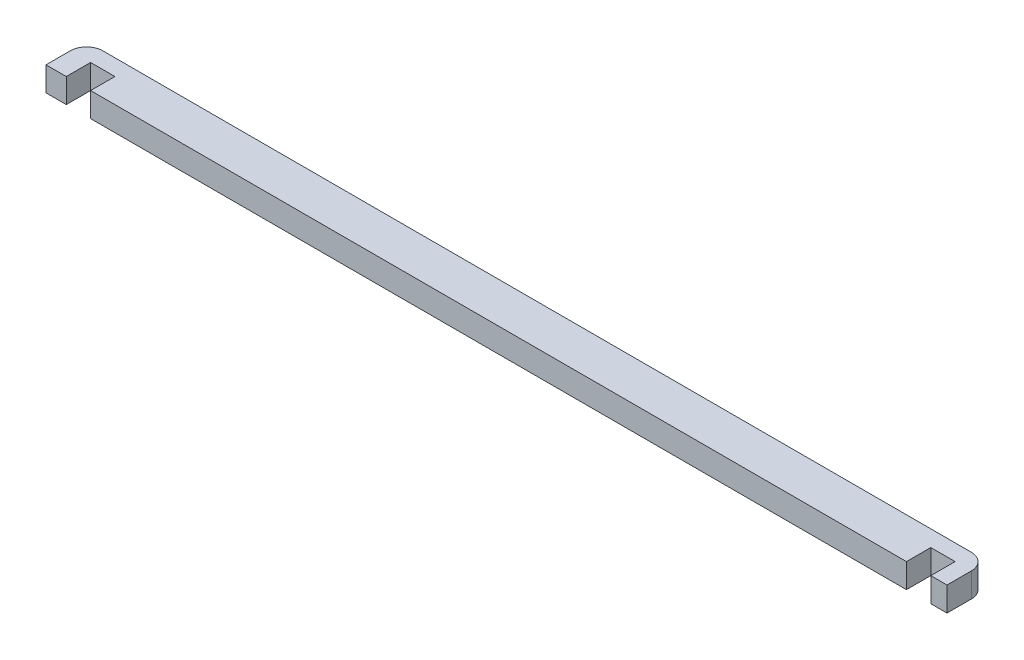
ISO-10303-21;
HEADER;
FILE_DESCRIPTION(('STEP AP214'),'2;1');
FILE_NAME('part.step','',(''),(''),'','','');
FILE_SCHEMA(('AUTOMOTIVE_DESIGN { 1 0 10303 214 1 1 1 1 }'));
ENDSEC;
DATA;
#1=APPLICATION_CONTEXT('core data for automotive mechanical design processes');
#2=APPLICATION_PROTOCOL_DEFINITION('international standard','automotive_design',2000,#1);
#3=PRODUCT_CONTEXT('',#1,'mechanical');
#4=PRODUCT('Part','Part','',(#3));
#5=PRODUCT_RELATED_PRODUCT_CATEGORY('part','',(#4));
#6=PRODUCT_DEFINITION_FORMATION('','',#4);
#7=PRODUCT_DEFINITION_CONTEXT('part definition',#1,'design');
#8=PRODUCT_DEFINITION('design','',#6,#7);
#9=PRODUCT_DEFINITION_SHAPE('','',#8);
#10=(LENGTH_UNIT() NAMED_UNIT(*) SI_UNIT(.MILLI.,.METRE.));
#11=(NAMED_UNIT(*) PLANE_ANGLE_UNIT() SI_UNIT($,.RADIAN.));
#12=(NAMED_UNIT(*) SI_UNIT($,.STERADIAN.) SOLID_ANGLE_UNIT());
#13=UNCERTAINTY_MEASURE_WITH_UNIT(LENGTH_MEASURE(1.E-05),#10,'distance_accuracy_value','');
#14=(GEOMETRIC_REPRESENTATION_CONTEXT(3) GLOBAL_UNCERTAINTY_ASSIGNED_CONTEXT((#13)) GLOBAL_UNIT_ASSIGNED_CONTEXT((#10,
#11,#12)) REPRESENTATION_CONTEXT('',''));
#15=CARTESIAN_POINT('',(0.,0.,0.));
#16=DIRECTION('',(0.,0.,1.));
#17=DIRECTION('',(1.,0.,0.));
#18=AXIS2_PLACEMENT_3D('',#15,#16,#17);
#19=CARTESIAN_POINT('',(0.,3.,0.));
#20=DIRECTION('',(1.,0.,0.));
#21=DIRECTION('',(0.,0.,-1.));
#22=AXIS2_PLACEMENT_3D('',#19,#20,#21);
#23=PLANE('',#22);
#24=DIRECTION('',(0.,0.,1.));
#25=VECTOR('',#24,1.);
#26=CARTESIAN_POINT('',(0.,3.,0.));
#27=LINE('',#26,#25);
#28=CARTESIAN_POINT('',(0.,3.,-3.));
#29=VERTEX_POINT('',#28);
#30=CARTESIAN_POINT('',(0.,3.,0.));
#31=VERTEX_POINT('',#30);
#32=EDGE_CURVE('E135',#29,#31,#27,.T.);
#33=ORIENTED_EDGE('',*,*,#32,.F.);
#34=DIRECTION('',(0.,-1.,0.));
#35=VECTOR('',#34,1.);
#36=CARTESIAN_POINT('',(0.,3.,-3.));
#37=LINE('',#36,#35);
#38=CARTESIAN_POINT('',(0.,0.,-3.));
#39=VERTEX_POINT('',#38);
#40=EDGE_CURVE('E159',#29,#39,#37,.T.);
#41=ORIENTED_EDGE('',*,*,#40,.T.);
#42=DIRECTION('',(0.,0.,1.));
#43=VECTOR('',#42,1.);
#44=CARTESIAN_POINT('',(0.,0.,0.));
#45=LINE('',#44,#43);
#46=CARTESIAN_POINT('',(0.,0.,0.));
#47=VERTEX_POINT('',#46);
#48=EDGE_CURVE('E157',#39,#47,#45,.T.);
#49=ORIENTED_EDGE('',*,*,#48,.T.);
#50=DIRECTION('',(0.,-1.,0.));
#51=VECTOR('',#50,1.);
#52=CARTESIAN_POINT('',(0.,3.,0.));
#53=LINE('',#52,#51);
#54=EDGE_CURVE('E150',#31,#47,#53,.T.);
#55=ORIENTED_EDGE('',*,*,#54,.F.);
#56=EDGE_LOOP('',(#33,#41,#49,#55));
#57=FACE_BOUND('',#56,.T.);
#58=ADVANCED_FACE('F33',(#57),#23,.F.);
#59=CARTESIAN_POINT('',(0.,3.,0.));
#60=DIRECTION('',(0.,0.,-1.));
#61=DIRECTION('',(-1.,0.,0.));
#62=AXIS2_PLACEMENT_3D('',#59,#60,#61);
#63=PLANE('',#62);
#64=DIRECTION('',(1.,0.,0.));
#65=VECTOR('',#64,1.);
#66=CARTESIAN_POINT('',(0.,0.,0.));
#67=LINE('',#66,#65);
#68=CARTESIAN_POINT('',(2.5,0.,0.));
#69=VERTEX_POINT('',#68);
#70=EDGE_CURVE('E235',#47,#69,#67,.T.);
#71=ORIENTED_EDGE('',*,*,#70,.T.);
#72=DIRECTION('',(0.,-1.,0.));
#73=VECTOR('',#72,1.);
#74=CARTESIAN_POINT('',(2.5,3.,0.));
#75=LINE('',#74,#73);
#76=CARTESIAN_POINT('',(2.5,3.,0.));
#77=VERTEX_POINT('',#76);
#78=EDGE_CURVE('E152',#77,#69,#75,.T.);
#79=ORIENTED_EDGE('',*,*,#78,.F.);
#80=DIRECTION('',(1.,0.,0.));
#81=VECTOR('',#80,1.);
#82=CARTESIAN_POINT('',(0.,3.,0.));
#83=LINE('',#82,#81);
#84=EDGE_CURVE('E138',#31,#77,#83,.T.);
#85=ORIENTED_EDGE('',*,*,#84,.F.);
#86=ORIENTED_EDGE('',*,*,#54,.T.);
#87=EDGE_LOOP('',(#71,#79,#85,#86));
#88=FACE_BOUND('',#87,.T.);
#89=ADVANCED_FACE('F149',(#88),#63,.F.);
#90=CARTESIAN_POINT('',(2.5,3.,0.));
#91=DIRECTION('',(-1.,0.,0.));
#92=DIRECTION('',(0.,0.,1.));
#93=AXIS2_PLACEMENT_3D('',#90,#91,#92);
#94=PLANE('',#93);
#95=DIRECTION('',(0.,0.,-1.));
#96=VECTOR('',#95,1.);
#97=CARTESIAN_POINT('',(2.5,0.,0.));
#98=LINE('',#97,#96);
#99=CARTESIAN_POINT('',(2.5,0.,-3.));
#100=VERTEX_POINT('',#99);
#101=EDGE_CURVE('E229',#69,#100,#98,.T.);
#102=ORIENTED_EDGE('',*,*,#101,.T.);
#103=DIRECTION('',(0.,-1.,0.));
#104=VECTOR('',#103,1.);
#105=CARTESIAN_POINT('',(2.5,3.,-3.));
#106=LINE('',#105,#104);
#107=CARTESIAN_POINT('',(2.5,3.,-3.));
#108=VERTEX_POINT('',#107);
#109=EDGE_CURVE('E163',#108,#100,#106,.T.);
#110=ORIENTED_EDGE('',*,*,#109,.F.);
#111=DIRECTION('',(0.,0.,-1.));
#112=VECTOR('',#111,1.);
#113=CARTESIAN_POINT('',(2.5,3.,0.));
#114=LINE('',#113,#112);
#115=EDGE_CURVE('E154',#77,#108,#114,.T.);
#116=ORIENTED_EDGE('',*,*,#115,.F.);
#117=ORIENTED_EDGE('',*,*,#78,.T.);
#118=EDGE_LOOP('',(#102,#110,#116,#117));
#119=FACE_BOUND('',#118,.T.);
#120=ADVANCED_FACE('F261',(#119),#94,.F.);
#121=CARTESIAN_POINT('',(2.5,3.,-3.));
#122=DIRECTION('',(0.,0.,-1.));
#123=DIRECTION('',(-1.,0.,0.));
#124=AXIS2_PLACEMENT_3D('',#121,#122,#123);
#125=PLANE('',#124);
#126=DIRECTION('',(1.,0.,0.));
#127=VECTOR('',#126,1.);
#128=CARTESIAN_POINT('',(2.5,0.,-3.));
#129=LINE('',#128,#127);
#130=CARTESIAN_POINT('',(5.5,0.,-3.));
#131=VERTEX_POINT('',#130);
#132=EDGE_CURVE('E224',#100,#131,#129,.T.);
#133=ORIENTED_EDGE('',*,*,#132,.T.);
#134=DIRECTION('',(0.,-1.,0.));
#135=VECTOR('',#134,1.);
#136=CARTESIAN_POINT('',(5.5,3.,-3.));
#137=LINE('',#136,#135);
#138=CARTESIAN_POINT('',(5.5,3.,-3.));
#139=VERTEX_POINT('',#138);
#140=EDGE_CURVE('E215',#139,#131,#137,.T.);
#141=ORIENTED_EDGE('',*,*,#140,.F.);
#142=DIRECTION('',(1.,0.,0.));
#143=VECTOR('',#142,1.);
#144=CARTESIAN_POINT('',(2.5,3.,-3.));
#145=LINE('',#144,#143);
#146=EDGE_CURVE('E225',#108,#139,#145,.T.);
#147=ORIENTED_EDGE('',*,*,#146,.F.);
#148=ORIENTED_EDGE('',*,*,#109,.T.);
#149=EDGE_LOOP('',(#133,#141,#147,#148));
#150=FACE_BOUND('',#149,.T.);
#151=ADVANCED_FACE('F222',(#150),#125,.F.);
#152=CARTESIAN_POINT('',(5.5,3.,0.));
#153=DIRECTION('',(1.,0.,0.));
#154=DIRECTION('',(0.,0.,-1.));
#155=AXIS2_PLACEMENT_3D('',#152,#153,#154);
#156=PLANE('',#155);
#157=DIRECTION('',(0.,0.,1.));
#158=VECTOR('',#157,1.);
#159=CARTESIAN_POINT('',(5.5,0.,0.));
#160=LINE('',#159,#158);
#161=CARTESIAN_POINT('',(5.5,0.,0.));
#162=VERTEX_POINT('',#161);
#163=EDGE_CURVE('E231',#131,#162,#160,.T.);
#164=ORIENTED_EDGE('',*,*,#163,.T.);
#165=DIRECTION('',(0.,-1.,0.));
#166=VECTOR('',#165,1.);
#167=CARTESIAN_POINT('',(5.5,3.,0.));
#168=LINE('',#167,#166);
#169=CARTESIAN_POINT('',(5.5,3.,0.));
#170=VERTEX_POINT('',#169);
#171=EDGE_CURVE('E212',#170,#162,#168,.T.);
#172=ORIENTED_EDGE('',*,*,#171,.F.);
#173=DIRECTION('',(0.,0.,1.));
#174=VECTOR('',#173,1.);
#175=CARTESIAN_POINT('',(5.5,3.,0.));
#176=LINE('',#175,#174);
#177=EDGE_CURVE('E263',#139,#170,#176,.T.);
#178=ORIENTED_EDGE('',*,*,#177,.F.);
#179=ORIENTED_EDGE('',*,*,#140,.T.);
#180=EDGE_LOOP('',(#164,#172,#178,#179));
#181=FACE_BOUND('',#180,.T.);
#182=ADVANCED_FACE('F285',(#181),#156,.F.);
#183=CARTESIAN_POINT('',(5.5,3.,0.));
#184=DIRECTION('',(0.,0.,-1.));
#185=DIRECTION('',(-1.,0.,0.));
#186=AXIS2_PLACEMENT_3D('',#183,#184,#185);
#187=PLANE('',#186);
#188=DIRECTION('',(1.,0.,0.));
#189=VECTOR('',#188,1.);
#190=CARTESIAN_POINT('',(5.5,0.,0.));
#191=LINE('',#190,#189);
#192=CARTESIAN_POINT('',(106.1,0.,0.));
#193=VERTEX_POINT('',#192);
#194=EDGE_CURVE('E233',#162,#193,#191,.T.);
#195=ORIENTED_EDGE('',*,*,#194,.T.);
#196=DIRECTION('',(0.,-1.,0.));
#197=VECTOR('',#196,1.);
#198=CARTESIAN_POINT('',(106.1,3.,0.));
#199=LINE('',#198,#197);
#200=CARTESIAN_POINT('',(106.1,3.,0.));
#201=VERTEX_POINT('',#200);
#202=EDGE_CURVE('E209',#201,#193,#199,.T.);
#203=ORIENTED_EDGE('',*,*,#202,.F.);
#204=DIRECTION('',(1.,0.,0.));
#205=VECTOR('',#204,1.);
#206=CARTESIAN_POINT('',(5.5,3.,0.));
#207=LINE('',#206,#205);
#208=EDGE_CURVE('E267',#170,#201,#207,.T.);
#209=ORIENTED_EDGE('',*,*,#208,.F.);
#210=ORIENTED_EDGE('',*,*,#171,.T.);
#211=EDGE_LOOP('',(#195,#203,#209,#210));
#212=FACE_BOUND('',#211,.T.);
#213=ADVANCED_FACE('F281',(#212),#187,.F.);
#214=CARTESIAN_POINT('',(106.1,3.,0.));
#215=DIRECTION('',(-1.,0.,0.));
#216=DIRECTION('',(0.,0.,1.));
#217=AXIS2_PLACEMENT_3D('',#214,#215,#216);
#218=PLANE('',#217);
#219=DIRECTION('',(0.,0.,-1.));
#220=VECTOR('',#219,1.);
#221=CARTESIAN_POINT('',(106.1,0.,0.));
#222=LINE('',#221,#220);
#223=CARTESIAN_POINT('',(106.1,0.,-2.99999999999999));
#224=VERTEX_POINT('',#223);
#225=EDGE_CURVE('E240',#193,#224,#222,.T.);
#226=ORIENTED_EDGE('',*,*,#225,.T.);
#227=DIRECTION('',(0.,-1.,0.));
#228=VECTOR('',#227,1.);
#229=CARTESIAN_POINT('',(106.1,3.,-2.99999999999999));
#230=LINE('',#229,#228);
#231=CARTESIAN_POINT('',(106.1,3.,-2.99999999999999));
#232=VERTEX_POINT('',#231);
#233=EDGE_CURVE('E206',#232,#224,#230,.T.);
#234=ORIENTED_EDGE('',*,*,#233,.F.);
#235=DIRECTION('',(0.,0.,-1.));
#236=VECTOR('',#235,1.);
#237=CARTESIAN_POINT('',(106.1,3.,0.));
#238=LINE('',#237,#236);
#239=EDGE_CURVE('E269',#201,#232,#238,.T.);
#240=ORIENTED_EDGE('',*,*,#239,.F.);
#241=ORIENTED_EDGE('',*,*,#202,.T.);
#242=EDGE_LOOP('',(#226,#234,#240,#241));
#243=FACE_BOUND('',#242,.T.);
#244=ADVANCED_FACE('F277',(#243),#218,.F.);
#245=CARTESIAN_POINT('',(106.1,3.,-2.99999999999999));
#246=DIRECTION('',(0.,0.,-1.));
#247=DIRECTION('',(-1.,0.,0.));
#248=AXIS2_PLACEMENT_3D('',#245,#246,#247);
#249=PLANE('',#248);
#250=DIRECTION('',(1.,0.,0.));
#251=VECTOR('',#250,1.);
#252=CARTESIAN_POINT('',(106.1,0.,-2.99999999999999));
#253=LINE('',#252,#251);
#254=CARTESIAN_POINT('',(109.1,0.,-2.99999999999999));
#255=VERTEX_POINT('',#254);
#256=EDGE_CURVE('E242',#224,#255,#253,.T.);
#257=ORIENTED_EDGE('',*,*,#256,.T.);
#258=DIRECTION('',(0.,-1.,0.));
#259=VECTOR('',#258,1.);
#260=CARTESIAN_POINT('',(109.1,3.,-2.99999999999999));
#261=LINE('',#260,#259);
#262=CARTESIAN_POINT('',(109.1,3.,-2.99999999999999));
#263=VERTEX_POINT('',#262);
#264=EDGE_CURVE('E203',#263,#255,#261,.T.);
#265=ORIENTED_EDGE('',*,*,#264,.F.);
#266=DIRECTION('',(1.,0.,0.));
#267=VECTOR('',#266,1.);
#268=CARTESIAN_POINT('',(106.1,3.,-2.99999999999999));
#269=LINE('',#268,#267);
#270=EDGE_CURVE('E257',#232,#263,#269,.T.);
#271=ORIENTED_EDGE('',*,*,#270,.F.);
#272=ORIENTED_EDGE('',*,*,#233,.T.);
#273=EDGE_LOOP('',(#257,#265,#271,#272));
#274=FACE_BOUND('',#273,.T.);
#275=ADVANCED_FACE('F274',(#274),#249,.F.);
#276=CARTESIAN_POINT('',(109.1,3.,0.));
#277=DIRECTION('',(1.,0.,0.));
#278=DIRECTION('',(0.,0.,-1.));
#279=AXIS2_PLACEMENT_3D('',#276,#277,#278);
#280=PLANE('',#279);
#281=DIRECTION('',(0.,0.,1.));
#282=VECTOR('',#281,1.);
#283=CARTESIAN_POINT('',(109.1,0.,0.));
#284=LINE('',#283,#282);
#285=CARTESIAN_POINT('',(109.1,0.,0.));
#286=VERTEX_POINT('',#285);
#287=EDGE_CURVE('E195',#255,#286,#284,.T.);
#288=ORIENTED_EDGE('',*,*,#287,.T.);
#289=DIRECTION('',(0.,-1.,0.));
#290=VECTOR('',#289,1.);
#291=CARTESIAN_POINT('',(109.1,3.,0.));
#292=LINE('',#291,#290);
#293=CARTESIAN_POINT('',(109.1,3.,0.));
#294=VERTEX_POINT('',#293);
#295=EDGE_CURVE('E200',#294,#286,#292,.T.);
#296=ORIENTED_EDGE('',*,*,#295,.F.);
#297=DIRECTION('',(0.,0.,1.));
#298=VECTOR('',#297,1.);
#299=CARTESIAN_POINT('',(109.1,3.,0.));
#300=LINE('',#299,#298);
#301=EDGE_CURVE('E254',#263,#294,#300,.T.);
#302=ORIENTED_EDGE('',*,*,#301,.F.);
#303=ORIENTED_EDGE('',*,*,#264,.T.);
#304=EDGE_LOOP('',(#288,#296,#302,#303));
#305=FACE_BOUND('',#304,.T.);
#306=ADVANCED_FACE('F246',(#305),#280,.F.);
#307=CARTESIAN_POINT('',(109.1,3.,0.));
#308=DIRECTION('',(0.,0.,-1.));
#309=DIRECTION('',(-1.,0.,0.));
#310=AXIS2_PLACEMENT_3D('',#307,#308,#309);
#311=PLANE('',#310);
#312=DIRECTION('',(1.,0.,0.));
#313=VECTOR('',#312,1.);
#314=CARTESIAN_POINT('',(109.1,0.,0.));
#315=LINE('',#314,#313);
#316=CARTESIAN_POINT('',(111.1,0.,0.));
#317=VERTEX_POINT('',#316);
#318=EDGE_CURVE('E192',#286,#317,#315,.T.);
#319=ORIENTED_EDGE('',*,*,#318,.T.);
#320=DIRECTION('',(0.,-1.,0.));
#321=VECTOR('',#320,1.);
#322=CARTESIAN_POINT('',(111.1,3.,0.));
#323=LINE('',#322,#321);
#324=CARTESIAN_POINT('',(111.1,3.,0.));
#325=VERTEX_POINT('',#324);
#326=EDGE_CURVE('E182',#325,#317,#323,.T.);
#327=ORIENTED_EDGE('',*,*,#326,.F.);
#328=DIRECTION('',(1.,0.,0.));
#329=VECTOR('',#328,1.);
#330=CARTESIAN_POINT('',(109.1,3.,0.));
#331=LINE('',#330,#329);
#332=EDGE_CURVE('E253',#294,#325,#331,.T.);
#333=ORIENTED_EDGE('',*,*,#332,.F.);
#334=ORIENTED_EDGE('',*,*,#295,.T.);
#335=EDGE_LOOP('',(#319,#327,#333,#334));
#336=FACE_BOUND('',#335,.T.);
#337=ADVANCED_FACE('F252',(#336),#311,.F.);
#338=CARTESIAN_POINT('',(111.1,3.,0.));
#339=DIRECTION('',(-1.,0.,0.));
#340=DIRECTION('',(0.,0.,1.));
#341=AXIS2_PLACEMENT_3D('',#338,#339,#340);
#342=PLANE('',#341);
#343=DIRECTION('',(0.,0.,-1.));
#344=VECTOR('',#343,1.);
#345=CARTESIAN_POINT('',(111.1,0.,0.));
#346=LINE('',#345,#344);
#347=CARTESIAN_POINT('',(111.1,0.,-3.));
#348=VERTEX_POINT('',#347);
#349=EDGE_CURVE('E188',#317,#348,#346,.T.);
#350=ORIENTED_EDGE('',*,*,#349,.T.);
#351=DIRECTION('',(0.,-1.,0.));
#352=VECTOR('',#351,1.);
#353=CARTESIAN_POINT('',(111.1,3.,-3.));
#354=LINE('',#353,#352);
#355=CARTESIAN_POINT('',(111.1,3.,-3.));
#356=VERTEX_POINT('',#355);
#357=EDGE_CURVE('E11',#348,#356,#354,.F.);
#358=ORIENTED_EDGE('',*,*,#357,.T.);
#359=DIRECTION('',(0.,0.,-1.));
#360=VECTOR('',#359,1.);
#361=CARTESIAN_POINT('',(111.1,3.,0.));
#362=LINE('',#361,#360);
#363=EDGE_CURVE('E177',#325,#356,#362,.T.);
#364=ORIENTED_EDGE('',*,*,#363,.F.);
#365=ORIENTED_EDGE('',*,*,#326,.T.);
#366=EDGE_LOOP('',(#350,#358,#364,#365));
#367=FACE_BOUND('',#366,.T.);
#368=ADVANCED_FACE('F190',(#367),#342,.F.);
#369=CARTESIAN_POINT('',(0.,3.,-5.));
#370=DIRECTION('',(0.,0.,1.));
#371=DIRECTION('',(1.,0.,0.));
#372=AXIS2_PLACEMENT_3D('',#369,#370,#371);
#373=PLANE('',#372);
#374=DIRECTION('',(-1.,0.,0.));
#375=VECTOR('',#374,1.);
#376=CARTESIAN_POINT('',(0.,0.,-5.));
#377=LINE('',#376,#375);
#378=CARTESIAN_POINT('',(109.1,0.,-5.));
#379=VERTEX_POINT('',#378);
#380=CARTESIAN_POINT('',(2.,0.,-5.));
#381=VERTEX_POINT('',#380);
#382=EDGE_CURVE('E145',#379,#381,#377,.T.);
#383=ORIENTED_EDGE('',*,*,#382,.T.);
#384=DIRECTION('',(0.,-1.,0.));
#385=VECTOR('',#384,1.);
#386=CARTESIAN_POINT('',(2.,3.,-5.));
#387=LINE('',#386,#385);
#388=CARTESIAN_POINT('',(2.,3.,-5.));
#389=VERTEX_POINT('',#388);
#390=EDGE_CURVE('E54',#381,#389,#387,.F.);
#391=ORIENTED_EDGE('',*,*,#390,.T.);
#392=DIRECTION('',(-1.,0.,0.));
#393=VECTOR('',#392,1.);
#394=CARTESIAN_POINT('',(0.,3.,-5.));
#395=LINE('',#394,#393);
#396=CARTESIAN_POINT('',(109.1,3.,-5.));
#397=VERTEX_POINT('',#396);
#398=EDGE_CURVE('E176',#397,#389,#395,.T.);
#399=ORIENTED_EDGE('',*,*,#398,.F.);
#400=DIRECTION('',(0.,-1.,0.));
#401=VECTOR('',#400,1.);
#402=CARTESIAN_POINT('',(109.1,3.,-5.));
#403=LINE('',#402,#401);
#404=EDGE_CURVE('E170',#397,#379,#403,.T.);
#405=ORIENTED_EDGE('',*,*,#404,.T.);
#406=EDGE_LOOP('',(#383,#391,#399,#405));
#407=FACE_BOUND('',#406,.T.);
#408=ADVANCED_FACE('F180',(#407),#373,.F.);
#409=CARTESIAN_POINT('',(0.,3.,0.));
#410=DIRECTION('',(0.,-1.,0.));
#411=DIRECTION('',(0.,0.,-1.));
#412=AXIS2_PLACEMENT_3D('',#409,#410,#411);
#413=PLANE('',#412);
#414=ORIENTED_EDGE('',*,*,#398,.T.);
#415=CARTESIAN_POINT('',(2.,3.,-3.));
#416=DIRECTION('',(0.,-1.,0.));
#417=DIRECTION('',(0.,0.,-1.));
#418=AXIS2_PLACEMENT_3D('',#415,#416,#417);
#419=CIRCLE('',#418,2.);
#420=EDGE_CURVE('E41',#389,#29,#419,.F.);
#421=ORIENTED_EDGE('',*,*,#420,.T.);
#422=ORIENTED_EDGE('',*,*,#32,.T.);
#423=ORIENTED_EDGE('',*,*,#84,.T.);
#424=ORIENTED_EDGE('',*,*,#115,.T.);
#425=ORIENTED_EDGE('',*,*,#146,.T.);
#426=ORIENTED_EDGE('',*,*,#177,.T.);
#427=ORIENTED_EDGE('',*,*,#208,.T.);
#428=ORIENTED_EDGE('',*,*,#239,.T.);
#429=ORIENTED_EDGE('',*,*,#270,.T.);
#430=ORIENTED_EDGE('',*,*,#301,.T.);
#431=ORIENTED_EDGE('',*,*,#332,.T.);
#432=ORIENTED_EDGE('',*,*,#363,.T.);
#433=CARTESIAN_POINT('',(109.1,3.,-3.));
#434=DIRECTION('',(0.,-1.,0.));
#435=DIRECTION('',(0.,0.,-1.));
#436=AXIS2_PLACEMENT_3D('',#433,#434,#435);
#437=CIRCLE('',#436,2.);
#438=EDGE_CURVE('E174',#356,#397,#437,.F.);
#439=ORIENTED_EDGE('',*,*,#438,.T.);
#440=EDGE_LOOP('',(#414,#421,#422,#423,#424,#425,#426,#427,#428,#429,#430,#431,#432,#439));
#441=FACE_BOUND('',#440,.T.);
#442=ADVANCED_FACE('F137',(#441),#413,.F.);
#443=CARTESIAN_POINT('',(0.,0.,0.));
#444=DIRECTION('',(0.,-1.,0.));
#445=DIRECTION('',(0.,0.,-1.));
#446=AXIS2_PLACEMENT_3D('',#443,#444,#445);
#447=PLANE('',#446);
#448=ORIENTED_EDGE('',*,*,#48,.F.);
#449=CARTESIAN_POINT('',(2.,0.,-3.));
#450=DIRECTION('',(0.,-1.,0.));
#451=DIRECTION('',(0.,0.,-1.));
#452=AXIS2_PLACEMENT_3D('',#449,#450,#451);
#453=CIRCLE('',#452,2.);
#454=EDGE_CURVE('E168',#39,#381,#453,.T.);
#455=ORIENTED_EDGE('',*,*,#454,.T.);
#456=ORIENTED_EDGE('',*,*,#382,.F.);
#457=CARTESIAN_POINT('',(109.1,0.,-3.));
#458=DIRECTION('',(0.,-1.,0.));
#459=DIRECTION('',(0.,0.,-1.));
#460=AXIS2_PLACEMENT_3D('',#457,#458,#459);
#461=CIRCLE('',#460,2.);
#462=EDGE_CURVE('E161',#379,#348,#461,.T.);
#463=ORIENTED_EDGE('',*,*,#462,.T.);
#464=ORIENTED_EDGE('',*,*,#349,.F.);
#465=ORIENTED_EDGE('',*,*,#318,.F.);
#466=ORIENTED_EDGE('',*,*,#287,.F.);
#467=ORIENTED_EDGE('',*,*,#256,.F.);
#468=ORIENTED_EDGE('',*,*,#225,.F.);
#469=ORIENTED_EDGE('',*,*,#194,.F.);
#470=ORIENTED_EDGE('',*,*,#163,.F.);
#471=ORIENTED_EDGE('',*,*,#132,.F.);
#472=ORIENTED_EDGE('',*,*,#101,.F.);
#473=ORIENTED_EDGE('',*,*,#70,.F.);
#474=EDGE_LOOP('',(#448,#455,#456,#463,#464,#465,#466,#467,#468,#469,#470,#471,#472,#473));
#475=FACE_BOUND('',#474,.T.);
#476=ADVANCED_FACE('F186',(#475),#447,.T.);
#477=CARTESIAN_POINT('',(2.,3.,-3.));
#478=DIRECTION('',(0.,-1.,0.));
#479=DIRECTION('',(0.,0.,-1.));
#480=AXIS2_PLACEMENT_3D('',#477,#478,#479);
#481=CYLINDRICAL_SURFACE('',#480,2.);
#482=ORIENTED_EDGE('',*,*,#420,.F.);
#483=ORIENTED_EDGE('',*,*,#390,.F.);
#484=ORIENTED_EDGE('',*,*,#454,.F.);
#485=ORIENTED_EDGE('',*,*,#40,.F.);
#486=EDGE_LOOP('',(#482,#483,#484,#485));
#487=FACE_BOUND('',#486,.T.);
#488=ADVANCED_FACE('F301',(#487),#481,.T.);
#489=CARTESIAN_POINT('',(109.1,3.,-3.));
#490=DIRECTION('',(0.,-1.,0.));
#491=DIRECTION('',(0.,0.,-1.));
#492=AXIS2_PLACEMENT_3D('',#489,#490,#491);
#493=CYLINDRICAL_SURFACE('',#492,2.);
#494=ORIENTED_EDGE('',*,*,#438,.F.);
#495=ORIENTED_EDGE('',*,*,#357,.F.);
#496=ORIENTED_EDGE('',*,*,#462,.F.);
#497=ORIENTED_EDGE('',*,*,#404,.F.);
#498=EDGE_LOOP('',(#494,#495,#496,#497));
#499=FACE_BOUND('',#498,.T.);
#500=ADVANCED_FACE('F35',(#499),#493,.T.);
#501=CLOSED_SHELL('',(#58,#89,#120,#151,#182,#213,#244,#275,#306,#337,#368,#408,#442,#476,#488,#500));
#502=MANIFOLD_SOLID_BREP('B2',#501);
#503=ADVANCED_BREP_SHAPE_REPRESENTATION('',(#18,#502),#14);
#504=SHAPE_DEFINITION_REPRESENTATION(#9,#503);
ENDSEC;
END-ISO-10303-21;
